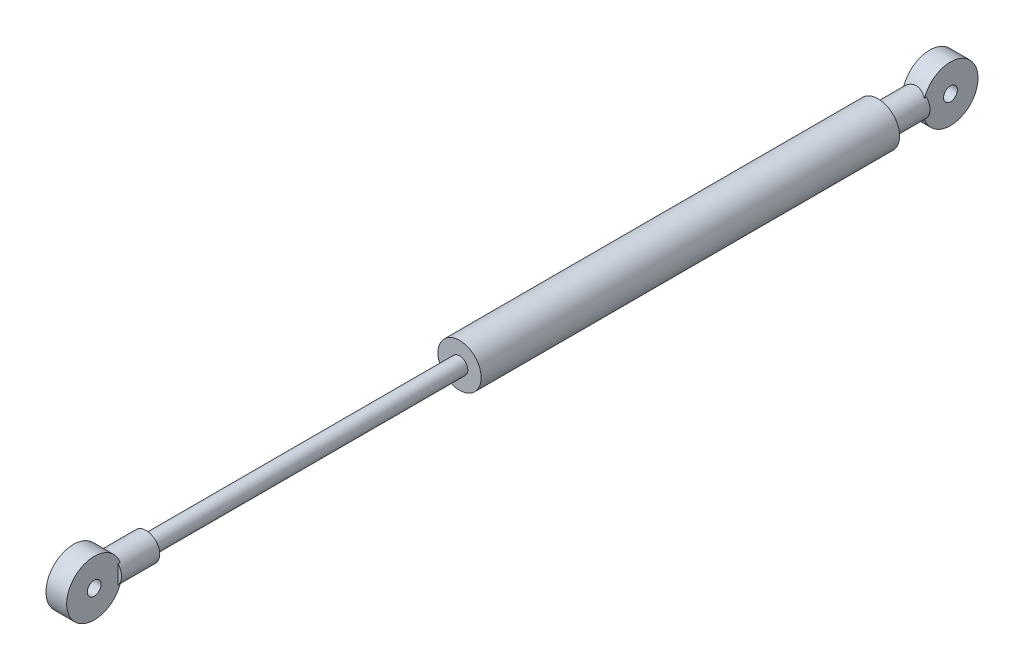
ISO-10303-21;
HEADER;
FILE_DESCRIPTION(('STEP AP214'),'2;1');
FILE_NAME('part.step','',(''),(''),'','','');
FILE_SCHEMA(('AUTOMOTIVE_DESIGN { 1 0 10303 214 1 1 1 1 }'));
ENDSEC;
DATA;
#1=APPLICATION_CONTEXT('core data for automotive mechanical design processes');
#2=APPLICATION_PROTOCOL_DEFINITION('international standard','automotive_design',2000,#1);
#3=PRODUCT_CONTEXT('',#1,'mechanical');
#4=PRODUCT('Part','Part','',(#3));
#5=PRODUCT_RELATED_PRODUCT_CATEGORY('part','',(#4));
#6=PRODUCT_DEFINITION_FORMATION('','',#4);
#7=PRODUCT_DEFINITION_CONTEXT('part definition',#1,'design');
#8=PRODUCT_DEFINITION('design','',#6,#7);
#9=PRODUCT_DEFINITION_SHAPE('','',#8);
#10=(LENGTH_UNIT() NAMED_UNIT(*) SI_UNIT(.MILLI.,.METRE.));
#11=(NAMED_UNIT(*) PLANE_ANGLE_UNIT() SI_UNIT($,.RADIAN.));
#12=(NAMED_UNIT(*) SI_UNIT($,.STERADIAN.) SOLID_ANGLE_UNIT());
#13=UNCERTAINTY_MEASURE_WITH_UNIT(LENGTH_MEASURE(1.E-05),#10,'distance_accuracy_value','');
#14=(GEOMETRIC_REPRESENTATION_CONTEXT(3) GLOBAL_UNCERTAINTY_ASSIGNED_CONTEXT((#13)) GLOBAL_UNIT_ASSIGNED_CONTEXT((#10,
#11,#12)) REPRESENTATION_CONTEXT('',''));
#15=CARTESIAN_POINT('',(0.,0.,0.));
#16=DIRECTION('',(0.,0.,1.));
#17=DIRECTION('',(1.,0.,0.));
#18=AXIS2_PLACEMENT_3D('',#15,#16,#17);
#19=CARTESIAN_POINT('',(0.,0.,172.681752408757));
#20=DIRECTION('',(0.,0.,1.));
#21=DIRECTION('',(0.,-1.,0.));
#22=AXIS2_PLACEMENT_3D('',#19,#20,#21);
#23=CYLINDRICAL_SURFACE('',#22,2.99999999999998);
#24=DIRECTION('',(0.,0.,1.));
#25=VECTOR('',#24,1.);
#26=CARTESIAN_POINT('',(2.25,1.98431348329842,172.681752408757));
#27=LINE('',#26,#25);
#28=CARTESIAN_POINT('',(2.25,1.98431348329842,180.98559998605));
#29=VERTEX_POINT('',#28);
#30=CARTESIAN_POINT('',(2.25,1.98431348329842,180.519376582304));
#31=VERTEX_POINT('',#30);
#32=EDGE_CURVE('E94',#29,#31,#27,.F.);
#33=ORIENTED_EDGE('',*,*,#32,.F.);
#34=CARTESIAN_POINT('',(0.,0.,180.98559998605));
#35=DIRECTION('',(0.,0.,1.));
#36=DIRECTION('',(0.,-1.,0.));
#37=AXIS2_PLACEMENT_3D('',#34,#35,#36);
#38=CIRCLE('',#37,2.99999999999998);
#39=CARTESIAN_POINT('',(2.25,-1.98431348329841,180.98559998605));
#40=VERTEX_POINT('',#39);
#41=EDGE_CURVE('E233',#40,#29,#38,.T.);
#42=ORIENTED_EDGE('',*,*,#41,.F.);
#43=DIRECTION('',(0.,0.,1.));
#44=VECTOR('',#43,1.);
#45=CARTESIAN_POINT('',(2.25,-1.98431348329842,172.681752408757));
#46=LINE('',#45,#44);
#47=CARTESIAN_POINT('',(2.25,-1.98431348329841,180.519376582304));
#48=VERTEX_POINT('',#47);
#49=EDGE_CURVE('E107',#48,#40,#46,.T.);
#50=ORIENTED_EDGE('',*,*,#49,.F.);
#51=CARTESIAN_POINT('',(2.25,-1.98431348329841,180.519376582304));
#52=CARTESIAN_POINT('',(2.13816063704798,-2.11108516363985,180.563751757154));
#53=CARTESIAN_POINT('',(2.01588160066686,-2.22815952458,180.609615350601));
#54=CARTESIAN_POINT('',(1.75208272835814,-2.44114953523773,180.69958932043));
#55=CARTESIAN_POINT('',(1.61043780861579,-2.53691602089614,180.743685667649));
#56=CARTESIAN_POINT('',(1.3107287042693,-2.7039604208588,180.824764048741));
#57=CARTESIAN_POINT('',(1.15262111448042,-2.7751713489293,180.861726502829));
#58=CARTESIAN_POINT('',(0.906910245268827,-2.86095007213829,180.907665280061));
#59=CARTESIAN_POINT('',(0.823726308302179,-2.88601253409324,180.921379182376));
#60=CARTESIAN_POINT('',(0.655019686419036,-2.92890881543682,180.945140844415));
#61=CARTESIAN_POINT('',(0.569498374433521,-2.94674678492575,180.955190708608));
#62=CARTESIAN_POINT('',(0.403586827598561,-2.97382336947511,180.97055329196));
#63=CARTESIAN_POINT('',(0.323316154990016,-2.98362383542491,180.976174162061));
#64=CARTESIAN_POINT('',(0.162030699641896,-2.99671381647978,180.983698521913));
#65=CARTESIAN_POINT('',(0.081015601377071,-3.00000042944225,180.985600354701));
#66=CARTESIAN_POINT('',(-0.0782248221161788,-2.99999958535089,180.985599630099));
#67=CARTESIAN_POINT('',(-0.156450113279761,-2.9969346881355,180.983825867411));
#68=CARTESIAN_POINT('',(-0.312277007137009,-2.98472853342183,180.976808908551));
#69=CARTESIAN_POINT('',(-0.389878358684429,-2.97558494203083,180.971564379793));
#70=CARTESIAN_POINT('',(-0.621007960929015,-2.93915396988956,180.950862004815));
#71=CARTESIAN_POINT('',(-0.772783621248346,-2.90286654123617,180.930435646493));
#72=CARTESIAN_POINT('',(-1.06638611917204,-2.80830273320203,180.879276195217));
#73=CARTESIAN_POINT('',(-1.20825963322721,-2.75013913567999,180.848596054168));
#74=CARTESIAN_POINT('',(-1.48026566040242,-2.6137989458878,180.78047034048));
#75=CARTESIAN_POINT('',(-1.61039705190612,-2.53562044451019,180.743024122564));
#76=CARTESIAN_POINT('',(-1.82853332195372,-2.38118139543784,180.673995236932));
#77=CARTESIAN_POINT('',(-1.91936200799324,-2.30857934589532,180.643032850846));
#78=CARTESIAN_POINT('',(-2.09174028463982,-2.15360157841686,180.580950375769));
#79=CARTESIAN_POINT('',(-2.17331347630865,-2.07125186589232,180.549830909352));
#80=CARTESIAN_POINT('',(-2.25,-1.98431348329842,180.519376582304));
#81=B_SPLINE_CURVE_WITH_KNOTS('',3,(#51,#52,#53,#54,#55,#56,#57,#58,#59,#60,#61,#62,#63,#64,#65,
#66,#67,#68,#69,#70,#71,#72,#73,#74,#75,#76,#77,#78,#79,#80),.UNSPECIFIED.,.F.,.F.,(4,2,2,2,2,2,
2,2,2,2,2,2,2,2,4),(0.,0.523806767405271,1.05117245771471,1.57996559849132,1.84349191439982,
2.10686663250718,2.3497149881904,2.59267151675817,2.82725881730433,3.06193623885689,
3.53152216837908,3.99871962856722,4.46596166866854,4.82623354034363,5.18556504691815),.UNSPECIFIED.);
#82=CARTESIAN_POINT('',(-2.25,-1.98431348329841,180.519376582304));
#83=VERTEX_POINT('',#82);
#84=EDGE_CURVE('E93',#48,#83,#81,.T.);
#85=ORIENTED_EDGE('',*,*,#84,.T.);
#86=DIRECTION('',(0.,0.,1.));
#87=VECTOR('',#86,1.);
#88=CARTESIAN_POINT('',(-2.25,-1.98431348329842,172.681752408757));
#89=LINE('',#88,#87);
#90=CARTESIAN_POINT('',(-2.25,-1.98431348329841,180.98559998605));
#91=VERTEX_POINT('',#90);
#92=EDGE_CURVE('E100',#83,#91,#89,.T.);
#93=ORIENTED_EDGE('',*,*,#92,.T.);
#94=CARTESIAN_POINT('',(-2.25,1.98431348329842,180.98559998605));
#95=VERTEX_POINT('',#94);
#96=EDGE_CURVE('E106',#95,#91,#38,.T.);
#97=ORIENTED_EDGE('',*,*,#96,.F.);
#98=DIRECTION('',(0.,0.,1.));
#99=VECTOR('',#98,1.);
#100=CARTESIAN_POINT('',(-2.25,1.98431348329842,172.681752408757));
#101=LINE('',#100,#99);
#102=CARTESIAN_POINT('',(-2.25,1.98431348329842,180.519376582304));
#103=VERTEX_POINT('',#102);
#104=EDGE_CURVE('E61',#95,#103,#101,.F.);
#105=ORIENTED_EDGE('',*,*,#104,.T.);
#106=CARTESIAN_POINT('',(-2.25,1.98431348329842,180.519376582304));
#107=CARTESIAN_POINT('',(-2.13813666082812,2.11115030276203,180.563775550007));
#108=CARTESIAN_POINT('',(-2.01576042330965,2.22829091794647,180.609667485202));
#109=CARTESIAN_POINT('',(-1.75189912913121,2.44126393816147,180.699641003066));
#110=CARTESIAN_POINT('',(-1.61031025079419,2.53697251441181,180.743710923331));
#111=CARTESIAN_POINT('',(-1.31091321285402,2.70387221953942,180.824723408074));
#112=CARTESIAN_POINT('',(-1.15306805921839,2.77500574844844,180.86164913986));
#113=CARTESIAN_POINT('',(-0.825601526936578,2.88934481033802,180.922860808828));
#114=CARTESIAN_POINT('',(-0.656014670598736,2.93262866085221,180.947182153607));
#115=CARTESIAN_POINT('',(-0.32464270355755,2.98670582599644,180.977860902012));
#116=CARTESIAN_POINT('',(-0.163372950606527,2.99989096310937,180.985538070437));
#117=CARTESIAN_POINT('',(0.159220391880617,3.00010759988012,180.985661071996));
#118=CARTESIAN_POINT('',(0.320543981913049,2.98713885137636,180.978106760606));
#119=CARTESIAN_POINT('',(0.623610975659732,2.93812611147971,180.950300926969));
#120=CARTESIAN_POINT('',(0.76582294097513,2.90422799392212,180.931233459125));
#121=CARTESIAN_POINT('',(1.04247229136281,2.81679187752137,180.883814996692));
#122=CARTESIAN_POINT('',(1.17690477173086,2.7632416415395,180.855458218945));
#123=CARTESIAN_POINT('',(1.44505950073326,2.6335554551026,180.790089407701));
#124=CARTESIAN_POINT('',(1.57799259653398,2.55604108746532,180.752592071079));
#125=CARTESIAN_POINT('',(1.82968118784103,2.38235535403617,180.674174627336));
#126=CARTESIAN_POINT('',(1.94845189493592,2.28620430252957,180.633258274377));
#127=CARTESIAN_POINT('',(2.12577521481116,2.11883432839665,180.567918018435));
#128=CARTESIAN_POINT('',(2.18943766564424,2.05298796258888,180.543431649894));
#129=CARTESIAN_POINT('',(2.25,1.98431348329842,180.519376582304));
#130=B_SPLINE_CURVE_WITH_KNOTS('',3,(#106,#107,#108,#109,#110,#111,#112,#113,#114,#115,#116,
#117,#118,#119,#120,#121,#122,#123,#124,#125,#126,#127,#128,#129),.UNSPECIFIED.,.F.,.F.,(4,2,2,
2,2,2,2,2,2,2,2,4),(0.,0.524109137853362,1.05117249748309,1.57946295879476,2.10626121767092,
2.58947483454299,3.07269303641705,3.51310566325874,3.95379299638218,4.42710067391626,
4.89989531067902,5.18392506929779),.UNSPECIFIED.);
#131=EDGE_CURVE('E87',#103,#31,#130,.T.);
#132=ORIENTED_EDGE('',*,*,#131,.T.);
#133=EDGE_LOOP('',(#33,#42,#50,#85,#93,#97,#105,#132));
#134=FACE_BOUND('',#133,.T.);
#135=CARTESIAN_POINT('',(0.,0.,172.681752408757));
#136=DIRECTION('',(0.,0.,1.));
#137=DIRECTION('',(0.,-1.,0.));
#138=AXIS2_PLACEMENT_3D('',#135,#136,#137);
#139=CIRCLE('',#138,2.99999999999998);
#140=CARTESIAN_POINT('',(0.,-2.99999999999998,172.681752408757));
#141=VERTEX_POINT('',#140);
#142=EDGE_CURVE('E234',#141,#141,#139,.T.);
#143=ORIENTED_EDGE('',*,*,#142,.T.);
#144=EDGE_LOOP('',(#143));
#145=FACE_BOUND('',#144,.T.);
#146=ADVANCED_FACE('F46',(#134,#145),#23,.T.);
#147=CARTESIAN_POINT('',(0.,0.,180.98559998605));
#148=DIRECTION('',(0.,0.,1.));
#149=DIRECTION('',(0.,-1.,0.));
#150=AXIS2_PLACEMENT_3D('',#147,#148,#149);
#151=PLANE('',#150);
#152=ORIENTED_EDGE('',*,*,#96,.T.);
#153=DIRECTION('',(0.,1.,0.));
#154=VECTOR('',#153,1.);
#155=CARTESIAN_POINT('',(-2.25,0.,180.98559998605));
#156=LINE('',#155,#154);
#157=EDGE_CURVE('E54',#91,#95,#156,.T.);
#158=ORIENTED_EDGE('',*,*,#157,.T.);
#159=EDGE_LOOP('',(#152,#158));
#160=FACE_BOUND('',#159,.T.);
#161=ADVANCED_FACE('F139',(#160),#151,.T.);
#162=CARTESIAN_POINT('',(0.,0.,104.5));
#163=DIRECTION('',(0.,0.,1.));
#164=DIRECTION('',(0.,-1.,0.));
#165=AXIS2_PLACEMENT_3D('',#162,#163,#164);
#166=PLANE('',#165);
#167=CARTESIAN_POINT('',(0.,0.,104.5));
#168=DIRECTION('',(0.,0.,1.));
#169=DIRECTION('',(0.,-1.,0.));
#170=AXIS2_PLACEMENT_3D('',#167,#168,#169);
#171=CIRCLE('',#170,1.80000000000001);
#172=CARTESIAN_POINT('',(0.,-1.80000000000002,104.5));
#173=VERTEX_POINT('',#172);
#174=EDGE_CURVE('E241',#173,#173,#171,.T.);
#175=ORIENTED_EDGE('',*,*,#174,.F.);
#176=EDGE_LOOP('',(#175));
#177=FACE_BOUND('',#176,.T.);
#178=ADVANCED_FACE('F48',(#177),#166,.F.);
#179=CARTESIAN_POINT('',(0.,0.,172.681752408757));
#180=DIRECTION('',(0.,0.,1.));
#181=DIRECTION('',(0.,-1.,0.));
#182=AXIS2_PLACEMENT_3D('',#179,#180,#181);
#183=CYLINDRICAL_SURFACE('',#182,1.80000000000001);
#184=ORIENTED_EDGE('',*,*,#174,.T.);
#185=EDGE_LOOP('',(#184));
#186=FACE_BOUND('',#185,.T.);
#187=CARTESIAN_POINT('',(0.,0.,172.681752408757));
#188=DIRECTION('',(0.,0.,1.));
#189=DIRECTION('',(0.,-1.,0.));
#190=AXIS2_PLACEMENT_3D('',#187,#188,#189);
#191=CIRCLE('',#190,1.8);
#192=CARTESIAN_POINT('',(0.,-1.8,172.681752408757));
#193=VERTEX_POINT('',#192);
#194=EDGE_CURVE('E236',#193,#193,#191,.T.);
#195=ORIENTED_EDGE('',*,*,#194,.F.);
#196=EDGE_LOOP('',(#195));
#197=FACE_BOUND('',#196,.T.);
#198=ADVANCED_FACE('F143',(#186,#197),#183,.T.);
#199=CARTESIAN_POINT('',(0.,0.,172.681752408757));
#200=DIRECTION('',(0.,0.,1.));
#201=DIRECTION('',(0.,-1.,0.));
#202=AXIS2_PLACEMENT_3D('',#199,#200,#201);
#203=PLANE('',#202);
#204=ORIENTED_EDGE('',*,*,#142,.F.);
#205=EDGE_LOOP('',(#204));
#206=FACE_BOUND('',#205,.T.);
#207=ORIENTED_EDGE('',*,*,#194,.T.);
#208=EDGE_LOOP('',(#207));
#209=FACE_BOUND('',#208,.T.);
#210=ADVANCED_FACE('F137',(#206,#209),#203,.F.);
#211=DIRECTION('',(0.,1.,0.));
#212=VECTOR('',#211,1.);
#213=CARTESIAN_POINT('',(2.25,0.,180.98559998605));
#214=LINE('',#213,#212);
#215=EDGE_CURVE('E12',#40,#29,#214,.T.);
#216=ORIENTED_EDGE('',*,*,#215,.F.);
#217=ORIENTED_EDGE('',*,*,#41,.T.);
#218=EDGE_LOOP('',(#216,#217));
#219=FACE_BOUND('',#218,.T.);
#220=ADVANCED_FACE('F133',(#219),#151,.T.);
#221=CARTESIAN_POINT('',(2.25,0.,186.181752408757));
#222=DIRECTION('',(-1.,0.,0.));
#223=DIRECTION('',(0.,0.,1.));
#224=AXIS2_PLACEMENT_3D('',#221,#222,#223);
#225=CYLINDRICAL_SURFACE('',#224,6.00000000000002);
#226=CARTESIAN_POINT('',(-2.25,0.,186.181752408757));
#227=DIRECTION('',(1.,0.,0.));
#228=DIRECTION('',(0.,0.,-1.));
#229=AXIS2_PLACEMENT_3D('',#226,#227,#228);
#230=CIRCLE('',#229,6.00000000000002);
#231=EDGE_CURVE('E89',#103,#83,#230,.T.);
#232=ORIENTED_EDGE('',*,*,#231,.T.);
#233=ORIENTED_EDGE('',*,*,#84,.F.);
#234=CARTESIAN_POINT('',(2.25,0.,186.181752408757));
#235=DIRECTION('',(1.,0.,0.));
#236=DIRECTION('',(0.,0.,-1.));
#237=AXIS2_PLACEMENT_3D('',#234,#235,#236);
#238=CIRCLE('',#237,6.00000000000002);
#239=EDGE_CURVE('E91',#31,#48,#238,.T.);
#240=ORIENTED_EDGE('',*,*,#239,.F.);
#241=ORIENTED_EDGE('',*,*,#131,.F.);
#242=EDGE_LOOP('',(#232,#233,#240,#241));
#243=FACE_BOUND('',#242,.T.);
#244=ADVANCED_FACE('F88',(#243),#225,.T.);
#245=CARTESIAN_POINT('',(2.25,0.,186.181752408757));
#246=DIRECTION('',(-1.,0.,0.));
#247=DIRECTION('',(0.,0.,1.));
#248=AXIS2_PLACEMENT_3D('',#245,#246,#247);
#249=CYLINDRICAL_SURFACE('',#248,1.5);
#250=CARTESIAN_POINT('',(2.25,0.,186.181752408757));
#251=DIRECTION('',(1.,0.,0.));
#252=DIRECTION('',(0.,0.,-1.));
#253=AXIS2_PLACEMENT_3D('',#250,#251,#252);
#254=CIRCLE('',#253,1.5);
#255=CARTESIAN_POINT('',(2.25,0.,184.681752408757));
#256=VERTEX_POINT('',#255);
#257=EDGE_CURVE('E110',#256,#256,#254,.T.);
#258=ORIENTED_EDGE('',*,*,#257,.T.);
#259=EDGE_LOOP('',(#258));
#260=FACE_BOUND('',#259,.T.);
#261=CARTESIAN_POINT('',(-2.25,0.,186.181752408757));
#262=DIRECTION('',(1.,0.,0.));
#263=DIRECTION('',(0.,0.,-1.));
#264=AXIS2_PLACEMENT_3D('',#261,#262,#263);
#265=CIRCLE('',#264,1.5);
#266=CARTESIAN_POINT('',(-2.25,0.,184.681752408757));
#267=VERTEX_POINT('',#266);
#268=EDGE_CURVE('E101',#267,#267,#265,.T.);
#269=ORIENTED_EDGE('',*,*,#268,.F.);
#270=EDGE_LOOP('',(#269));
#271=FACE_BOUND('',#270,.T.);
#272=ADVANCED_FACE('F132',(#260,#271),#249,.F.);
#273=CARTESIAN_POINT('',(2.25,0.,0.));
#274=DIRECTION('',(1.,0.,0.));
#275=DIRECTION('',(0.,0.,-1.));
#276=AXIS2_PLACEMENT_3D('',#273,#274,#275);
#277=PLANE('',#276);
#278=ORIENTED_EDGE('',*,*,#215,.T.);
#279=ORIENTED_EDGE('',*,*,#32,.T.);
#280=ORIENTED_EDGE('',*,*,#239,.T.);
#281=ORIENTED_EDGE('',*,*,#49,.T.);
#282=EDGE_LOOP('',(#278,#279,#280,#281));
#283=FACE_BOUND('',#282,.T.);
#284=ORIENTED_EDGE('',*,*,#257,.F.);
#285=EDGE_LOOP('',(#284));
#286=FACE_BOUND('',#285,.T.);
#287=ADVANCED_FACE('F194',(#283,#286),#277,.T.);
#288=CARTESIAN_POINT('',(-2.25,0.,0.));
#289=DIRECTION('',(1.,0.,0.));
#290=DIRECTION('',(0.,0.,-1.));
#291=AXIS2_PLACEMENT_3D('',#288,#289,#290);
#292=PLANE('',#291);
#293=ORIENTED_EDGE('',*,*,#104,.F.);
#294=ORIENTED_EDGE('',*,*,#157,.F.);
#295=ORIENTED_EDGE('',*,*,#92,.F.);
#296=ORIENTED_EDGE('',*,*,#231,.F.);
#297=EDGE_LOOP('',(#293,#294,#295,#296));
#298=FACE_BOUND('',#297,.T.);
#299=ORIENTED_EDGE('',*,*,#268,.T.);
#300=EDGE_LOOP('',(#299));
#301=FACE_BOUND('',#300,.T.);
#302=ADVANCED_FACE('F97',(#298,#301),#292,.F.);
#303=CLOSED_SHELL('',(#146,#161,#178,#198,#210,#220,#244,#272,#287,#302));
#304=MANIFOLD_SOLID_BREP('B2',#303);
#305=CARTESIAN_POINT('',(2.25,0.,0.));
#306=DIRECTION('',(-1.,0.,0.));
#307=DIRECTION('',(0.,0.,1.));
#308=AXIS2_PLACEMENT_3D('',#305,#306,#307);
#309=CYLINDRICAL_SURFACE('',#308,6.);
#310=CARTESIAN_POINT('',(2.25,1.98431348329844,5.66237582645306));
#311=CARTESIAN_POINT('',(2.13813666082812,2.11115030276206,5.61797685875006));
#312=CARTESIAN_POINT('',(2.01576042330965,2.22829091794649,5.57208492355505));
#313=CARTESIAN_POINT('',(1.7518991291312,2.4412639381615,5.48211140569146));
#314=CARTESIAN_POINT('',(1.61031025079418,2.53697251441184,5.4380414854258));
#315=CARTESIAN_POINT('',(1.31091321285401,2.70387221953945,5.35702900068316));
#316=CARTESIAN_POINT('',(1.15306805921838,2.77500574844847,5.32010326889698));
#317=CARTESIAN_POINT('',(0.825601526936564,2.88934481033804,5.25889159992873));
#318=CARTESIAN_POINT('',(0.65601467059872,2.93262866085224,5.23457025514984));
#319=CARTESIAN_POINT('',(0.324642703557533,2.98670582599646,5.20389150674515));
#320=CARTESIAN_POINT('',(0.163372950606509,2.99989096310939,5.1962143383203));
#321=CARTESIAN_POINT('',(-0.159220391880633,3.00010759988014,5.19609133676106));
#322=CARTESIAN_POINT('',(-0.320543981913064,2.98713885137638,5.20364564815083));
#323=CARTESIAN_POINT('',(-0.623610975659747,2.93812611147972,5.23145148178749));
#324=CARTESIAN_POINT('',(-0.765822940975145,2.90422799392213,5.25051894963233));
#325=CARTESIAN_POINT('',(-1.04247229136283,2.81679187752139,5.29793741206528));
#326=CARTESIAN_POINT('',(-1.17690477173088,2.76324164153951,5.32629418981174));
#327=CARTESIAN_POINT('',(-1.44505950073328,2.63355545510261,5.39166300105566));
#328=CARTESIAN_POINT('',(-1.577992596534,2.55604108746533,5.42916033767801));
#329=CARTESIAN_POINT('',(-1.82968118784106,2.38235535403617,5.50757778142113));
#330=CARTESIAN_POINT('',(-1.94845189493594,2.28620430252958,5.54849413438045));
#331=CARTESIAN_POINT('',(-2.12577521481118,2.11883432839666,5.61383439032238));
#332=CARTESIAN_POINT('',(-2.18943766564424,2.05298796258889,5.63832075886335));
#333=CARTESIAN_POINT('',(-2.25,1.98431348329844,5.66237582645306));
#334=B_SPLINE_CURVE_WITH_KNOTS('',3,(#310,#311,#312,#313,#314,#315,#316,#317,#318,#319,#320,
#321,#322,#323,#324,#325,#326,#327,#328,#329,#330,#331,#332,#333),.UNSPECIFIED.,.F.,.F.,(4,2,2,
2,2,2,2,2,2,2,2,4),(0.,0.524109137853357,1.05117249748309,1.57946295879477,2.10626121767093,
2.589474834543,3.07269303641706,3.51310566325875,3.95379299638219,4.42710067391629,
4.89989531067904,5.18392506929778),.UNSPECIFIED.);
#335=CARTESIAN_POINT('',(2.25,1.98431348329844,5.66237582645306));
#336=VERTEX_POINT('',#335);
#337=CARTESIAN_POINT('',(-2.25,1.98431348329844,5.66237582645306));
#338=VERTEX_POINT('',#337);
#339=EDGE_CURVE('E311',#336,#338,#334,.T.);
#340=ORIENTED_EDGE('',*,*,#339,.F.);
#341=CARTESIAN_POINT('',(2.25,0.,0.));
#342=DIRECTION('',(1.,0.,0.));
#343=DIRECTION('',(0.,0.,-1.));
#344=AXIS2_PLACEMENT_3D('',#341,#342,#343);
#345=CIRCLE('',#344,6.);
#346=CARTESIAN_POINT('',(2.25,-1.98431348329845,5.66237582645306));
#347=VERTEX_POINT('',#346);
#348=EDGE_CURVE('E312',#347,#336,#345,.T.);
#349=ORIENTED_EDGE('',*,*,#348,.F.);
#350=CARTESIAN_POINT('',(-2.25,-1.98431348329845,5.66237582645306));
#351=CARTESIAN_POINT('',(-2.13813666082812,-2.11115030276206,5.61797685875006));
#352=CARTESIAN_POINT('',(-2.01576042330965,-2.2282909179465,5.57208492355505));
#353=CARTESIAN_POINT('',(-1.7518991291312,-2.4412639381615,5.48211140569146));
#354=CARTESIAN_POINT('',(-1.61031025079418,-2.53697251441184,5.4380414854258));
#355=CARTESIAN_POINT('',(-1.31091321285401,-2.70387221953945,5.35702900068316));
#356=CARTESIAN_POINT('',(-1.15306805921838,-2.77500574844847,5.32010326889698));
#357=CARTESIAN_POINT('',(-0.825601526936564,-2.88934481033804,5.25889159992873));
#358=CARTESIAN_POINT('',(-0.65601467059872,-2.93262866085224,5.23457025514983));
#359=CARTESIAN_POINT('',(-0.324642703557533,-2.98670582599647,5.20389150674515));
#360=CARTESIAN_POINT('',(-0.163372950606509,-2.99989096310939,5.19621433832029));
#361=CARTESIAN_POINT('',(0.159220391880633,-3.00010759988014,5.19609133676106));
#362=CARTESIAN_POINT('',(0.320543981913065,-2.98713885137638,5.20364564815083));
#363=CARTESIAN_POINT('',(0.623610975659747,-2.93812611147972,5.23145148178749));
#364=CARTESIAN_POINT('',(0.765822940975145,-2.90422799392213,5.25051894963233));
#365=CARTESIAN_POINT('',(1.04247229136283,-2.81679187752139,5.29793741206528));
#366=CARTESIAN_POINT('',(1.17690477173088,-2.76324164153951,5.32629418981174));
#367=CARTESIAN_POINT('',(1.44505950073328,-2.63355545510261,5.39166300105566));
#368=CARTESIAN_POINT('',(1.577992596534,-2.55604108746533,5.42916033767801));
#369=CARTESIAN_POINT('',(1.82968118784106,-2.38235535403617,5.50757778142113));
#370=CARTESIAN_POINT('',(1.94845189493594,-2.28620430252958,5.54849413438045));
#371=CARTESIAN_POINT('',(2.12577521481118,-2.11883432839666,5.61383439032238));
#372=CARTESIAN_POINT('',(2.18943766564424,-2.0529879625889,5.63832075886335));
#373=CARTESIAN_POINT('',(2.25,-1.98431348329845,5.66237582645306));
#374=B_SPLINE_CURVE_WITH_KNOTS('',3,(#350,#351,#352,#353,#354,#355,#356,#357,#358,#359,#360,
#361,#362,#363,#364,#365,#366,#367,#368,#369,#370,#371,#372,#373),.UNSPECIFIED.,.F.,.F.,(4,2,2,
2,2,2,2,2,2,2,2,4),(0.,0.524109137853358,1.05117249748309,1.57946295879477,2.10626121767093,
2.589474834543,3.07269303641706,3.51310566325875,3.95379299638219,4.42710067391629,
4.89989531067904,5.18392506929778),.UNSPECIFIED.);
#375=CARTESIAN_POINT('',(-2.25,-1.98431348329845,5.66237582645306));
#376=VERTEX_POINT('',#375);
#377=EDGE_CURVE('E343',#376,#347,#374,.T.);
#378=ORIENTED_EDGE('',*,*,#377,.F.);
#379=CARTESIAN_POINT('',(-2.25,0.,0.));
#380=DIRECTION('',(1.,0.,0.));
#381=DIRECTION('',(0.,0.,-1.));
#382=AXIS2_PLACEMENT_3D('',#379,#380,#381);
#383=CIRCLE('',#382,6.);
#384=EDGE_CURVE('E356',#376,#338,#383,.T.);
#385=ORIENTED_EDGE('',*,*,#384,.T.);
#386=EDGE_LOOP('',(#340,#349,#378,#385));
#387=FACE_BOUND('',#386,.T.);
#388=ADVANCED_FACE('F258',(#387),#309,.T.);
#389=CARTESIAN_POINT('',(2.25,0.,0.));
#390=DIRECTION('',(1.,0.,0.));
#391=DIRECTION('',(0.,0.,-1.));
#392=AXIS2_PLACEMENT_3D('',#389,#390,#391);
#393=PLANE('',#392);
#394=CARTESIAN_POINT('',(2.25,0.,0.));
#395=DIRECTION('',(1.,0.,0.));
#396=DIRECTION('',(0.,0.,-1.));
#397=AXIS2_PLACEMENT_3D('',#394,#395,#396);
#398=CIRCLE('',#397,1.5);
#399=CARTESIAN_POINT('',(2.25,0.,-1.5));
#400=VERTEX_POINT('',#399);
#401=EDGE_CURVE('E353',#400,#400,#398,.T.);
#402=ORIENTED_EDGE('',*,*,#401,.F.);
#403=EDGE_LOOP('',(#402));
#404=FACE_BOUND('',#403,.T.);
#405=CARTESIAN_POINT('',(2.25,0.,0.));
#406=DIRECTION('',(1.,0.,0.));
#407=DIRECTION('',(0.,0.,-1.));
#408=AXIS2_PLACEMENT_3D('',#405,#406,#407);
#409=CIRCLE('',#408,5.56214886532175);
#410=CARTESIAN_POINT('',(2.25,1.98431348329844,5.19615242270663));
#411=VERTEX_POINT('',#410);
#412=CARTESIAN_POINT('',(2.25,-1.98431348329844,5.19615242270663));
#413=VERTEX_POINT('',#412);
#414=EDGE_CURVE('E273',#411,#413,#409,.T.);
#415=ORIENTED_EDGE('',*,*,#414,.T.);
#416=DIRECTION('',(0.,0.,-1.));
#417=VECTOR('',#416,1.);
#418=CARTESIAN_POINT('',(2.25,-1.98431348329845,13.5));
#419=LINE('',#418,#417);
#420=EDGE_CURVE('E349',#413,#347,#419,.F.);
#421=ORIENTED_EDGE('',*,*,#420,.T.);
#422=ORIENTED_EDGE('',*,*,#348,.T.);
#423=DIRECTION('',(0.,0.,-1.));
#424=VECTOR('',#423,1.);
#425=CARTESIAN_POINT('',(2.25,1.98431348329844,13.5));
#426=LINE('',#425,#424);
#427=EDGE_CURVE('E278',#336,#411,#426,.T.);
#428=ORIENTED_EDGE('',*,*,#427,.T.);
#429=EDGE_LOOP('',(#415,#421,#422,#428));
#430=FACE_BOUND('',#429,.T.);
#431=ADVANCED_FACE('F363',(#404,#430),#393,.T.);
#432=CARTESIAN_POINT('',(-2.25,0.,0.));
#433=DIRECTION('',(1.,0.,0.));
#434=DIRECTION('',(0.,0.,-1.));
#435=AXIS2_PLACEMENT_3D('',#432,#433,#434);
#436=PLANE('',#435);
#437=CARTESIAN_POINT('',(-2.25,0.,0.));
#438=DIRECTION('',(1.,0.,0.));
#439=DIRECTION('',(0.,0.,-1.));
#440=AXIS2_PLACEMENT_3D('',#437,#438,#439);
#441=CIRCLE('',#440,1.5);
#442=CARTESIAN_POINT('',(-2.25,0.,-1.5));
#443=VERTEX_POINT('',#442);
#444=EDGE_CURVE('E352',#443,#443,#441,.T.);
#445=ORIENTED_EDGE('',*,*,#444,.T.);
#446=EDGE_LOOP('',(#445));
#447=FACE_BOUND('',#446,.T.);
#448=DIRECTION('',(0.,0.,-1.));
#449=VECTOR('',#448,1.);
#450=CARTESIAN_POINT('',(-2.25,-1.98431348329845,13.5));
#451=LINE('',#450,#449);
#452=CARTESIAN_POINT('',(-2.25,-1.98431348329844,5.19615242270663));
#453=VERTEX_POINT('',#452);
#454=EDGE_CURVE('E44',#453,#376,#451,.F.);
#455=ORIENTED_EDGE('',*,*,#454,.F.);
#456=CARTESIAN_POINT('',(-2.25,0.,0.));
#457=DIRECTION('',(1.,0.,0.));
#458=DIRECTION('',(0.,0.,-1.));
#459=AXIS2_PLACEMENT_3D('',#456,#457,#458);
#460=CIRCLE('',#459,5.56214886532175);
#461=CARTESIAN_POINT('',(-2.25,1.98431348329844,5.19615242270663));
#462=VERTEX_POINT('',#461);
#463=EDGE_CURVE('E266',#462,#453,#460,.T.);
#464=ORIENTED_EDGE('',*,*,#463,.F.);
#465=DIRECTION('',(0.,0.,-1.));
#466=VECTOR('',#465,1.);
#467=CARTESIAN_POINT('',(-2.25,1.98431348329844,13.5));
#468=LINE('',#467,#466);
#469=EDGE_CURVE('E302',#338,#462,#468,.T.);
#470=ORIENTED_EDGE('',*,*,#469,.F.);
#471=ORIENTED_EDGE('',*,*,#384,.F.);
#472=EDGE_LOOP('',(#455,#464,#470,#471));
#473=FACE_BOUND('',#472,.T.);
#474=ADVANCED_FACE('F300',(#447,#473),#436,.F.);
#475=CARTESIAN_POINT('',(2.25,0.,0.));
#476=DIRECTION('',(-1.,0.,0.));
#477=DIRECTION('',(0.,0.,1.));
#478=AXIS2_PLACEMENT_3D('',#475,#476,#477);
#479=CYLINDRICAL_SURFACE('',#478,1.5);
#480=ORIENTED_EDGE('',*,*,#401,.T.);
#481=EDGE_LOOP('',(#480));
#482=FACE_BOUND('',#481,.T.);
#483=ORIENTED_EDGE('',*,*,#444,.F.);
#484=EDGE_LOOP('',(#483));
#485=FACE_BOUND('',#484,.T.);
#486=ADVANCED_FACE('F260',(#482,#485),#479,.F.);
#487=CARTESIAN_POINT('',(0.,0.,0.));
#488=DIRECTION('',(0.,0.,-1.));
#489=DIRECTION('',(0.,1.,0.));
#490=AXIS2_PLACEMENT_3D('',#487,#488,#489);
#491=SPHERICAL_SURFACE('',#490,6.);
#492=CARTESIAN_POINT('',(0.,0.,5.19615242270663));
#493=DIRECTION('',(0.,0.,-1.));
#494=DIRECTION('',(0.,1.,0.));
#495=AXIS2_PLACEMENT_3D('',#492,#493,#494);
#496=CIRCLE('',#495,3.);
#497=EDGE_CURVE('E310',#453,#462,#496,.T.);
#498=ORIENTED_EDGE('',*,*,#497,.T.);
#499=ORIENTED_EDGE('',*,*,#463,.T.);
#500=EDGE_LOOP('',(#498,#499));
#501=FACE_BOUND('',#500,.T.);
#502=ADVANCED_FACE('F314',(#501),#491,.F.);
#503=CARTESIAN_POINT('',(0.,0.,13.5));
#504=DIRECTION('',(0.,0.,-1.));
#505=DIRECTION('',(0.,1.,0.));
#506=AXIS2_PLACEMENT_3D('',#503,#504,#505);
#507=CYLINDRICAL_SURFACE('',#506,3.);
#508=ORIENTED_EDGE('',*,*,#420,.F.);
#509=EDGE_CURVE('E315',#411,#413,#496,.T.);
#510=ORIENTED_EDGE('',*,*,#509,.F.);
#511=ORIENTED_EDGE('',*,*,#427,.F.);
#512=ORIENTED_EDGE('',*,*,#339,.T.);
#513=ORIENTED_EDGE('',*,*,#469,.T.);
#514=ORIENTED_EDGE('',*,*,#497,.F.);
#515=ORIENTED_EDGE('',*,*,#454,.T.);
#516=ORIENTED_EDGE('',*,*,#377,.T.);
#517=EDGE_LOOP('',(#508,#510,#511,#512,#513,#514,#515,#516));
#518=FACE_BOUND('',#517,.T.);
#519=CARTESIAN_POINT('',(0.,0.,13.5));
#520=DIRECTION('',(0.,0.,-1.));
#521=DIRECTION('',(0.,1.,0.));
#522=AXIS2_PLACEMENT_3D('',#519,#520,#521);
#523=CIRCLE('',#522,3.);
#524=CARTESIAN_POINT('',(0.,3.,13.5));
#525=VERTEX_POINT('',#524);
#526=EDGE_CURVE('E316',#525,#525,#523,.T.);
#527=ORIENTED_EDGE('',*,*,#526,.T.);
#528=EDGE_LOOP('',(#527));
#529=FACE_BOUND('',#528,.T.);
#530=ADVANCED_FACE('F308',(#518,#529),#507,.T.);
#531=CARTESIAN_POINT('',(0.,0.,104.5));
#532=DIRECTION('',(0.,0.,-1.));
#533=DIRECTION('',(0.,1.,0.));
#534=AXIS2_PLACEMENT_3D('',#531,#532,#533);
#535=PLANE('',#534);
#536=CARTESIAN_POINT('',(0.,0.,104.5));
#537=DIRECTION('',(0.,0.,-1.));
#538=DIRECTION('',(0.,1.,0.));
#539=AXIS2_PLACEMENT_3D('',#536,#537,#538);
#540=CIRCLE('',#539,4.7);
#541=CARTESIAN_POINT('',(0.,4.69999999999999,104.5));
#542=VERTEX_POINT('',#541);
#543=EDGE_CURVE('E431',#542,#542,#540,.T.);
#544=ORIENTED_EDGE('',*,*,#543,.F.);
#545=EDGE_LOOP('',(#544));
#546=FACE_BOUND('',#545,.T.);
#547=ADVANCED_FACE('F337',(#546),#535,.F.);
#548=ORIENTED_EDGE('',*,*,#414,.F.);
#549=ORIENTED_EDGE('',*,*,#509,.T.);
#550=EDGE_LOOP('',(#548,#549));
#551=FACE_BOUND('',#550,.T.);
#552=ADVANCED_FACE('F340',(#551),#491,.F.);
#553=CARTESIAN_POINT('',(0.,0.,13.5));
#554=DIRECTION('',(0.,0.,1.));
#555=DIRECTION('',(0.,-1.,0.));
#556=AXIS2_PLACEMENT_3D('',#553,#554,#555);
#557=PLANE('',#556);
#558=ORIENTED_EDGE('',*,*,#526,.F.);
#559=EDGE_LOOP('',(#558));
#560=FACE_BOUND('',#559,.T.);
#561=CARTESIAN_POINT('',(0.,0.,13.5));
#562=DIRECTION('',(0.,0.,-1.));
#563=DIRECTION('',(0.,1.,0.));
#564=AXIS2_PLACEMENT_3D('',#561,#562,#563);
#565=CIRCLE('',#564,4.7);
#566=CARTESIAN_POINT('',(0.,4.7,13.5));
#567=VERTEX_POINT('',#566);
#568=EDGE_CURVE('E320',#567,#567,#565,.T.);
#569=ORIENTED_EDGE('',*,*,#568,.T.);
#570=EDGE_LOOP('',(#569));
#571=FACE_BOUND('',#570,.T.);
#572=ADVANCED_FACE('F338',(#560,#571),#557,.F.);
#573=CARTESIAN_POINT('',(0.,0.,13.5));
#574=DIRECTION('',(0.,0.,-1.));
#575=DIRECTION('',(0.,1.,0.));
#576=AXIS2_PLACEMENT_3D('',#573,#574,#575);
#577=CYLINDRICAL_SURFACE('',#576,4.7);
#578=ORIENTED_EDGE('',*,*,#543,.T.);
#579=EDGE_LOOP('',(#578));
#580=FACE_BOUND('',#579,.T.);
#581=ORIENTED_EDGE('',*,*,#568,.F.);
#582=EDGE_LOOP('',(#581));
#583=FACE_BOUND('',#582,.T.);
#584=ADVANCED_FACE('F370',(#580,#583),#577,.T.);
#585=CLOSED_SHELL('',(#388,#431,#474,#486,#502,#530,#547,#552,#572,#584));
#586=MANIFOLD_SOLID_BREP('B6',#585);
#587=ADVANCED_BREP_SHAPE_REPRESENTATION('',(#18,#304,#586),#14);
#588=SHAPE_DEFINITION_REPRESENTATION(#9,#587);
ENDSEC;
END-ISO-10303-21;
